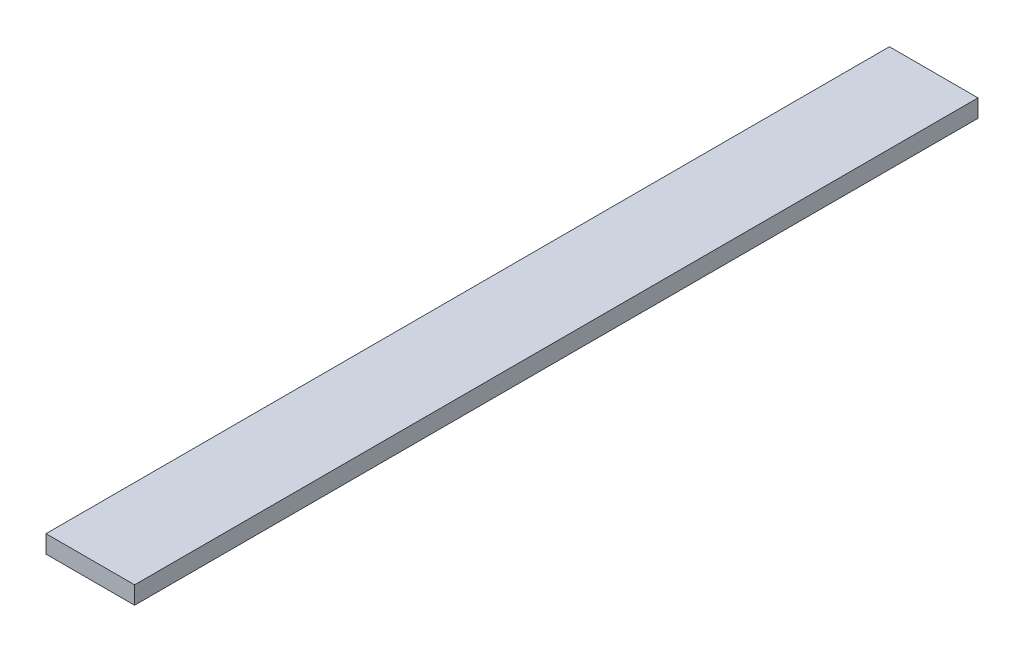
ISO-10303-21;
HEADER;
FILE_DESCRIPTION(('STEP AP214'),'2;1');
FILE_NAME('part.step','',(''),(''),'','','');
FILE_SCHEMA(('AUTOMOTIVE_DESIGN { 1 0 10303 214 1 1 1 1 }'));
ENDSEC;
DATA;
#1=APPLICATION_CONTEXT('core data for automotive mechanical design processes');
#2=APPLICATION_PROTOCOL_DEFINITION('international standard','automotive_design',2000,#1);
#3=PRODUCT_CONTEXT('',#1,'mechanical');
#4=PRODUCT('Part','Part','',(#3));
#5=PRODUCT_RELATED_PRODUCT_CATEGORY('part','',(#4));
#6=PRODUCT_DEFINITION_FORMATION('','',#4);
#7=PRODUCT_DEFINITION_CONTEXT('part definition',#1,'design');
#8=PRODUCT_DEFINITION('design','',#6,#7);
#9=PRODUCT_DEFINITION_SHAPE('','',#8);
#10=(LENGTH_UNIT() NAMED_UNIT(*) SI_UNIT(.MILLI.,.METRE.));
#11=(NAMED_UNIT(*) PLANE_ANGLE_UNIT() SI_UNIT($,.RADIAN.));
#12=(NAMED_UNIT(*) SI_UNIT($,.STERADIAN.) SOLID_ANGLE_UNIT());
#13=UNCERTAINTY_MEASURE_WITH_UNIT(LENGTH_MEASURE(1.E-05),#10,'distance_accuracy_value','');
#14=(GEOMETRIC_REPRESENTATION_CONTEXT(3) GLOBAL_UNCERTAINTY_ASSIGNED_CONTEXT((#13)) GLOBAL_UNIT_ASSIGNED_CONTEXT((#10,
#11,#12)) REPRESENTATION_CONTEXT('',''));
#15=CARTESIAN_POINT('',(0.,0.,0.));
#16=DIRECTION('',(0.,0.,1.));
#17=DIRECTION('',(1.,0.,0.));
#18=AXIS2_PLACEMENT_3D('',#15,#16,#17);
#19=CARTESIAN_POINT('',(0.,2.02999999999,0.));
#20=DIRECTION('',(0.,1.,0.));
#21=DIRECTION('',(-1.,0.,0.));
#22=AXIS2_PLACEMENT_3D('',#19,#20,#21);
#23=PLANE('',#22);
#24=DIRECTION('',(0.,0.,1.));
#25=VECTOR('',#24,1.);
#26=CARTESIAN_POINT('',(1.375,2.02999999999,0.195));
#27=LINE('',#26,#25);
#28=CARTESIAN_POINT('',(1.375,2.02999999999,0.195));
#29=VERTEX_POINT('',#28);
#30=CARTESIAN_POINT('',(1.375,2.02999999999,2.575));
#31=VERTEX_POINT('',#30);
#32=EDGE_CURVE('E80',#29,#31,#27,.T.);
#33=ORIENTED_EDGE('',*,*,#32,.T.);
#34=DIRECTION('',(-1.,0.,0.));
#35=VECTOR('',#34,1.);
#36=CARTESIAN_POINT('',(1.375,2.02999999999,2.575));
#37=LINE('',#36,#35);
#38=CARTESIAN_POINT('',(1.125,2.02999999999,2.575));
#39=VERTEX_POINT('',#38);
#40=EDGE_CURVE('E67',#31,#39,#37,.T.);
#41=ORIENTED_EDGE('',*,*,#40,.T.);
#42=DIRECTION('',(0.,0.,1.));
#43=VECTOR('',#42,1.);
#44=CARTESIAN_POINT('',(1.125,2.02999999999,0.195));
#45=LINE('',#44,#43);
#46=CARTESIAN_POINT('',(1.125,2.02999999999,0.195));
#47=VERTEX_POINT('',#46);
#48=EDGE_CURVE('E54',#39,#47,#45,.F.);
#49=ORIENTED_EDGE('',*,*,#48,.T.);
#50=DIRECTION('',(1.,0.,0.));
#51=VECTOR('',#50,1.);
#52=CARTESIAN_POINT('',(1.375,2.02999999999,0.195));
#53=LINE('',#52,#51);
#54=EDGE_CURVE('E19',#47,#29,#53,.T.);
#55=ORIENTED_EDGE('',*,*,#54,.T.);
#56=EDGE_LOOP('',(#33,#41,#49,#55));
#57=FACE_BOUND('',#56,.T.);
#58=ADVANCED_FACE('F16',(#57),#23,.F.);
#59=CARTESIAN_POINT('',(1.375,2.07999999999,0.195));
#60=DIRECTION('',(0.,0.,1.));
#61=DIRECTION('',(1.,0.,0.));
#62=AXIS2_PLACEMENT_3D('',#59,#60,#61);
#63=PLANE('',#62);
#64=DIRECTION('',(0.,1.,0.));
#65=VECTOR('',#64,1.);
#66=CARTESIAN_POINT('',(1.125,2.07999999999,0.195));
#67=LINE('',#66,#65);
#68=CARTESIAN_POINT('',(1.125,2.07999999999,0.195));
#69=VERTEX_POINT('',#68);
#70=EDGE_CURVE('E60',#47,#69,#67,.T.);
#71=ORIENTED_EDGE('',*,*,#70,.T.);
#72=DIRECTION('',(-1.,0.,0.));
#73=VECTOR('',#72,1.);
#74=CARTESIAN_POINT('',(0.,2.07999999999,0.195));
#75=LINE('',#74,#73);
#76=CARTESIAN_POINT('',(1.375,2.07999999999,0.195));
#77=VERTEX_POINT('',#76);
#78=EDGE_CURVE('E82',#77,#69,#75,.T.);
#79=ORIENTED_EDGE('',*,*,#78,.F.);
#80=DIRECTION('',(0.,-1.,0.));
#81=VECTOR('',#80,1.);
#82=CARTESIAN_POINT('',(1.375,2.07999999999,0.195));
#83=LINE('',#82,#81);
#84=EDGE_CURVE('E63',#77,#29,#83,.T.);
#85=ORIENTED_EDGE('',*,*,#84,.T.);
#86=ORIENTED_EDGE('',*,*,#54,.F.);
#87=EDGE_LOOP('',(#71,#79,#85,#86));
#88=FACE_BOUND('',#87,.T.);
#89=ADVANCED_FACE('F59',(#88),#63,.F.);
#90=CARTESIAN_POINT('',(1.125,2.07999999999,0.195));
#91=DIRECTION('',(1.,0.,0.));
#92=DIRECTION('',(0.,1.,0.));
#93=AXIS2_PLACEMENT_3D('',#90,#91,#92);
#94=PLANE('',#93);
#95=DIRECTION('',(0.,1.,0.));
#96=VECTOR('',#95,1.);
#97=CARTESIAN_POINT('',(1.125,2.07999999999,2.575));
#98=LINE('',#97,#96);
#99=CARTESIAN_POINT('',(1.125,2.07999999999,2.575));
#100=VERTEX_POINT('',#99);
#101=EDGE_CURVE('E69',#39,#100,#98,.T.);
#102=ORIENTED_EDGE('',*,*,#101,.T.);
#103=DIRECTION('',(0.,0.,1.));
#104=VECTOR('',#103,1.);
#105=CARTESIAN_POINT('',(1.125,2.07999999999,0.));
#106=LINE('',#105,#104);
#107=EDGE_CURVE('E73',#69,#100,#106,.T.);
#108=ORIENTED_EDGE('',*,*,#107,.F.);
#109=ORIENTED_EDGE('',*,*,#70,.F.);
#110=ORIENTED_EDGE('',*,*,#48,.F.);
#111=EDGE_LOOP('',(#102,#108,#109,#110));
#112=FACE_BOUND('',#111,.T.);
#113=ADVANCED_FACE('F71',(#112),#94,.F.);
#114=CARTESIAN_POINT('',(1.375,2.07999999999,2.575));
#115=DIRECTION('',(0.,0.,-1.));
#116=DIRECTION('',(-1.,0.,0.));
#117=AXIS2_PLACEMENT_3D('',#114,#115,#116);
#118=PLANE('',#117);
#119=DIRECTION('',(0.,-1.,0.));
#120=VECTOR('',#119,1.);
#121=CARTESIAN_POINT('',(1.375,2.07999999999,2.575));
#122=LINE('',#121,#120);
#123=CARTESIAN_POINT('',(1.375,2.07999999999,2.575));
#124=VERTEX_POINT('',#123);
#125=EDGE_CURVE('E34',#31,#124,#122,.F.);
#126=ORIENTED_EDGE('',*,*,#125,.T.);
#127=DIRECTION('',(-1.,0.,0.));
#128=VECTOR('',#127,1.);
#129=CARTESIAN_POINT('',(0.,2.07999999999,2.575));
#130=LINE('',#129,#128);
#131=EDGE_CURVE('E25',#100,#124,#130,.F.);
#132=ORIENTED_EDGE('',*,*,#131,.F.);
#133=ORIENTED_EDGE('',*,*,#101,.F.);
#134=ORIENTED_EDGE('',*,*,#40,.F.);
#135=EDGE_LOOP('',(#126,#132,#133,#134));
#136=FACE_BOUND('',#135,.T.);
#137=ADVANCED_FACE('F88',(#136),#118,.F.);
#138=CARTESIAN_POINT('',(1.375,2.07999999999,0.195));
#139=DIRECTION('',(-1.,0.,0.));
#140=DIRECTION('',(0.,-1.,0.));
#141=AXIS2_PLACEMENT_3D('',#138,#139,#140);
#142=PLANE('',#141);
#143=ORIENTED_EDGE('',*,*,#84,.F.);
#144=DIRECTION('',(0.,0.,1.));
#145=VECTOR('',#144,1.);
#146=CARTESIAN_POINT('',(1.375,2.07999999999,0.));
#147=LINE('',#146,#145);
#148=EDGE_CURVE('E11',#124,#77,#147,.F.);
#149=ORIENTED_EDGE('',*,*,#148,.F.);
#150=ORIENTED_EDGE('',*,*,#125,.F.);
#151=ORIENTED_EDGE('',*,*,#32,.F.);
#152=EDGE_LOOP('',(#143,#149,#150,#151));
#153=FACE_BOUND('',#152,.T.);
#154=ADVANCED_FACE('F90',(#153),#142,.F.);
#155=CARTESIAN_POINT('',(0.,2.07999999999,0.));
#156=DIRECTION('',(0.,1.,0.));
#157=DIRECTION('',(-1.,0.,0.));
#158=AXIS2_PLACEMENT_3D('',#155,#156,#157);
#159=PLANE('',#158);
#160=ORIENTED_EDGE('',*,*,#131,.T.);
#161=ORIENTED_EDGE('',*,*,#148,.T.);
#162=ORIENTED_EDGE('',*,*,#78,.T.);
#163=ORIENTED_EDGE('',*,*,#107,.T.);
#164=EDGE_LOOP('',(#160,#161,#162,#163));
#165=FACE_BOUND('',#164,.T.);
#166=ADVANCED_FACE('F87',(#165),#159,.T.);
#167=CLOSED_SHELL('',(#58,#89,#113,#137,#154,#166));
#168=MANIFOLD_SOLID_BREP('B1',#167);
#169=ADVANCED_BREP_SHAPE_REPRESENTATION('',(#18,#168),#14);
#170=SHAPE_DEFINITION_REPRESENTATION(#9,#169);
ENDSEC;
END-ISO-10303-21;
